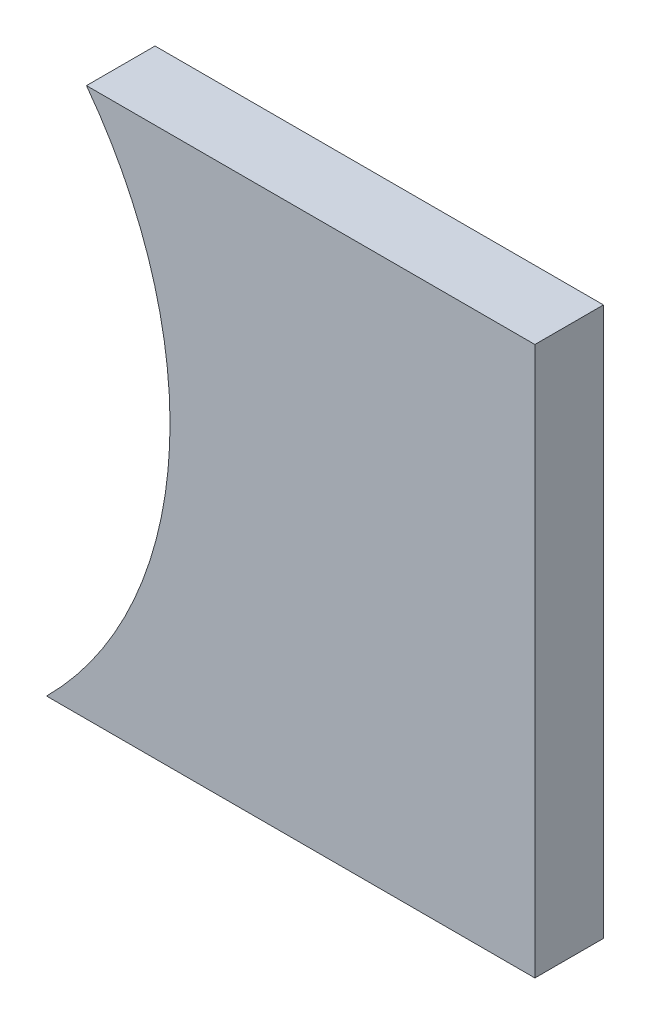
ISO-10303-21;
HEADER;
FILE_DESCRIPTION(('STEP AP214'),'2;1');
FILE_NAME('part.step','',(''),(''),'','','');
FILE_SCHEMA(('AUTOMOTIVE_DESIGN { 1 0 10303 214 1 1 1 1 }'));
ENDSEC;
DATA;
#1=APPLICATION_CONTEXT('core data for automotive mechanical design processes');
#2=APPLICATION_PROTOCOL_DEFINITION('international standard','automotive_design',2000,#1);
#3=PRODUCT_CONTEXT('',#1,'mechanical');
#4=PRODUCT('Part','Part','',(#3));
#5=PRODUCT_RELATED_PRODUCT_CATEGORY('part','',(#4));
#6=PRODUCT_DEFINITION_FORMATION('','',#4);
#7=PRODUCT_DEFINITION_CONTEXT('part definition',#1,'design');
#8=PRODUCT_DEFINITION('design','',#6,#7);
#9=PRODUCT_DEFINITION_SHAPE('','',#8);
#10=(LENGTH_UNIT() NAMED_UNIT(*) SI_UNIT(.MILLI.,.METRE.));
#11=(NAMED_UNIT(*) PLANE_ANGLE_UNIT() SI_UNIT($,.RADIAN.));
#12=(NAMED_UNIT(*) SI_UNIT($,.STERADIAN.) SOLID_ANGLE_UNIT());
#13=UNCERTAINTY_MEASURE_WITH_UNIT(LENGTH_MEASURE(1.E-05),#10,'distance_accuracy_value','');
#14=(GEOMETRIC_REPRESENTATION_CONTEXT(3) GLOBAL_UNCERTAINTY_ASSIGNED_CONTEXT((#13)) GLOBAL_UNIT_ASSIGNED_CONTEXT((#10,
#11,#12)) REPRESENTATION_CONTEXT('',''));
#15=CARTESIAN_POINT('',(0.,0.,0.));
#16=DIRECTION('',(0.,0.,1.));
#17=DIRECTION('',(1.,0.,0.));
#18=AXIS2_PLACEMENT_3D('',#15,#16,#17);
#19=CARTESIAN_POINT('',(0.,-8.65195884522402,-2.));
#20=DIRECTION('',(0.,-1.,0.));
#21=DIRECTION('',(1.,0.,0.));
#22=AXIS2_PLACEMENT_3D('',#19,#20,#21);
#23=PLANE('',#22);
#24=DIRECTION('',(0.,0.,1.));
#25=VECTOR('',#24,1.);
#26=CARTESIAN_POINT('',(48.1252101447609,-8.65195884522403,-10.));
#27=LINE('',#26,#25);
#28=CARTESIAN_POINT('',(48.1252101447609,-8.65195884522403,-2.));
#29=VERTEX_POINT('',#28);
#30=CARTESIAN_POINT('',(48.1252101447609,-8.65195884522403,0.));
#31=VERTEX_POINT('',#30);
#32=EDGE_CURVE('E52',#29,#31,#27,.T.);
#33=ORIENTED_EDGE('',*,*,#32,.F.);
#34=DIRECTION('',(1.,0.,0.));
#35=VECTOR('',#34,1.);
#36=CARTESIAN_POINT('',(0.,-8.65195884522402,-2.));
#37=LINE('',#36,#35);
#38=CARTESIAN_POINT('',(62.3676908739176,-8.65195884522404,-2.));
#39=VERTEX_POINT('',#38);
#40=EDGE_CURVE('E44',#29,#39,#37,.T.);
#41=ORIENTED_EDGE('',*,*,#40,.T.);
#42=DIRECTION('',(0.,0.,1.));
#43=VECTOR('',#42,1.);
#44=CARTESIAN_POINT('',(62.3676908739176,-8.65195884522404,-5.));
#45=LINE('',#44,#43);
#46=CARTESIAN_POINT('',(62.3676908739176,-8.65195884522404,0.));
#47=VERTEX_POINT('',#46);
#48=EDGE_CURVE('E97',#39,#47,#45,.T.);
#49=ORIENTED_EDGE('',*,*,#48,.T.);
#50=DIRECTION('',(1.,0.,0.));
#51=VECTOR('',#50,1.);
#52=CARTESIAN_POINT('',(0.,-8.65195884522402,0.));
#53=LINE('',#52,#51);
#54=EDGE_CURVE('E93',#31,#47,#53,.T.);
#55=ORIENTED_EDGE('',*,*,#54,.F.);
#56=EDGE_LOOP('',(#33,#41,#49,#55));
#57=FACE_BOUND('',#56,.T.);
#58=ADVANCED_FACE('F36',(#57),#23,.T.);
#59=CARTESIAN_POINT('',(-5.18945357340386E-13,7.3480411547712,-2.));
#60=DIRECTION('',(0.,1.,0.));
#61=DIRECTION('',(-1.,0.,0.));
#62=AXIS2_PLACEMENT_3D('',#59,#60,#61);
#63=PLANE('',#62);
#64=DIRECTION('',(0.,0.,1.));
#65=VECTOR('',#64,1.);
#66=CARTESIAN_POINT('',(49.2899732286247,7.34804115477561,-10.));
#67=LINE('',#66,#65);
#68=CARTESIAN_POINT('',(49.2899732286247,7.34804115477561,-2.));
#69=VERTEX_POINT('',#68);
#70=CARTESIAN_POINT('',(49.2899732286247,7.34804115477561,0.));
#71=VERTEX_POINT('',#70);
#72=EDGE_CURVE('E79',#69,#71,#67,.T.);
#73=ORIENTED_EDGE('',*,*,#72,.T.);
#74=DIRECTION('',(-1.,0.,0.));
#75=VECTOR('',#74,1.);
#76=CARTESIAN_POINT('',(-5.18945357340386E-13,7.3480411547712,0.));
#77=LINE('',#76,#75);
#78=CARTESIAN_POINT('',(62.3676908739176,7.34804115477561,0.));
#79=VERTEX_POINT('',#78);
#80=EDGE_CURVE('E39',#79,#71,#77,.T.);
#81=ORIENTED_EDGE('',*,*,#80,.F.);
#82=DIRECTION('',(0.,0.,1.));
#83=VECTOR('',#82,1.);
#84=CARTESIAN_POINT('',(62.3676908739176,7.34804115477561,-5.));
#85=LINE('',#84,#83);
#86=CARTESIAN_POINT('',(62.3676908739176,7.34804115477561,-2.));
#87=VERTEX_POINT('',#86);
#88=EDGE_CURVE('E60',#87,#79,#85,.T.);
#89=ORIENTED_EDGE('',*,*,#88,.F.);
#90=DIRECTION('',(-1.,0.,0.));
#91=VECTOR('',#90,1.);
#92=CARTESIAN_POINT('',(-5.18945357340386E-13,7.3480411547712,-2.));
#93=LINE('',#92,#91);
#94=EDGE_CURVE('E11',#87,#69,#93,.T.);
#95=ORIENTED_EDGE('',*,*,#94,.T.);
#96=EDGE_LOOP('',(#73,#81,#89,#95));
#97=FACE_BOUND('',#96,.T.);
#98=ADVANCED_FACE('F87',(#97),#63,.T.);
#99=CARTESIAN_POINT('',(0.,0.,-2.));
#100=DIRECTION('',(0.,0.,1.));
#101=DIRECTION('',(1.,0.,0.));
#102=AXIS2_PLACEMENT_3D('',#99,#100,#101);
#103=PLANE('',#102);
#104=ORIENTED_EDGE('',*,*,#40,.F.);
#105=CARTESIAN_POINT('',(39.4884879631215,0.0191706349962689,-2.));
#106=DIRECTION('',(0.,0.,1.));
#107=DIRECTION('',(1.,0.,0.));
#108=AXIS2_PLACEMENT_3D('',#105,#106,#107);
#109=CIRCLE('',#108,12.2385234610049);
#110=EDGE_CURVE('E89',#29,#69,#109,.T.);
#111=ORIENTED_EDGE('',*,*,#110,.T.);
#112=ORIENTED_EDGE('',*,*,#94,.F.);
#113=DIRECTION('',(0.,-1.,0.));
#114=VECTOR('',#113,1.);
#115=CARTESIAN_POINT('',(62.3676908739176,0.,-2.));
#116=LINE('',#115,#114);
#117=EDGE_CURVE('E95',#87,#39,#116,.T.);
#118=ORIENTED_EDGE('',*,*,#117,.T.);
#119=EDGE_LOOP('',(#104,#111,#112,#118));
#120=FACE_BOUND('',#119,.T.);
#121=ADVANCED_FACE('F107',(#120),#103,.F.);
#122=CARTESIAN_POINT('',(0.,0.,0.));
#123=DIRECTION('',(0.,0.,1.));
#124=DIRECTION('',(1.,0.,0.));
#125=AXIS2_PLACEMENT_3D('',#122,#123,#124);
#126=PLANE('',#125);
#127=CARTESIAN_POINT('',(39.4884879631215,0.0191706349962689,0.));
#128=DIRECTION('',(0.,0.,1.));
#129=DIRECTION('',(1.,0.,0.));
#130=AXIS2_PLACEMENT_3D('',#127,#128,#129);
#131=CIRCLE('',#130,12.2385234610049);
#132=EDGE_CURVE('E76',#31,#71,#131,.T.);
#133=ORIENTED_EDGE('',*,*,#132,.F.);
#134=ORIENTED_EDGE('',*,*,#54,.T.);
#135=DIRECTION('',(0.,-1.,0.));
#136=VECTOR('',#135,1.);
#137=CARTESIAN_POINT('',(62.3676908739176,0.,0.));
#138=LINE('',#137,#136);
#139=EDGE_CURVE('E92',#79,#47,#138,.T.);
#140=ORIENTED_EDGE('',*,*,#139,.F.);
#141=ORIENTED_EDGE('',*,*,#80,.T.);
#142=EDGE_LOOP('',(#133,#134,#140,#141));
#143=FACE_BOUND('',#142,.T.);
#144=ADVANCED_FACE('F91',(#143),#126,.T.);
#145=CARTESIAN_POINT('',(62.3676908739176,0.,-5.));
#146=DIRECTION('',(-1.,0.,0.));
#147=DIRECTION('',(0.,-1.,0.));
#148=AXIS2_PLACEMENT_3D('',#145,#146,#147);
#149=PLANE('',#148);
#150=ORIENTED_EDGE('',*,*,#88,.T.);
#151=ORIENTED_EDGE('',*,*,#139,.T.);
#152=ORIENTED_EDGE('',*,*,#48,.F.);
#153=ORIENTED_EDGE('',*,*,#117,.F.);
#154=EDGE_LOOP('',(#150,#151,#152,#153));
#155=FACE_BOUND('',#154,.T.);
#156=ADVANCED_FACE('F110',(#155),#149,.F.);
#157=CARTESIAN_POINT('',(39.4884879631215,0.0191706349962689,-10.));
#158=DIRECTION('',(0.,0.,1.));
#159=DIRECTION('',(1.,0.,0.));
#160=AXIS2_PLACEMENT_3D('',#157,#158,#159);
#161=CYLINDRICAL_SURFACE('',#160,12.2385234610049);
#162=ORIENTED_EDGE('',*,*,#32,.T.);
#163=ORIENTED_EDGE('',*,*,#132,.T.);
#164=ORIENTED_EDGE('',*,*,#72,.F.);
#165=ORIENTED_EDGE('',*,*,#110,.F.);
#166=EDGE_LOOP('',(#162,#163,#164,#165));
#167=FACE_BOUND('',#166,.T.);
#168=ADVANCED_FACE('F78',(#167),#161,.F.);
#169=CLOSED_SHELL('',(#58,#98,#121,#144,#156,#168));
#170=MANIFOLD_SOLID_BREP('B2',#169);
#171=ADVANCED_BREP_SHAPE_REPRESENTATION('',(#18,#170),#14);
#172=SHAPE_DEFINITION_REPRESENTATION(#9,#171);
ENDSEC;
END-ISO-10303-21;
